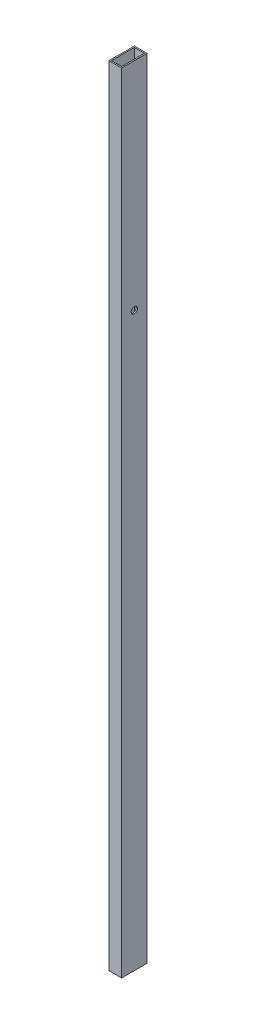
ISO-10303-21;
HEADER;
FILE_DESCRIPTION(('STEP AP214'),'2;1');
FILE_NAME('part.step','',(''),(''),'','','');
FILE_SCHEMA(('AUTOMOTIVE_DESIGN { 1 0 10303 214 1 1 1 1 }'));
ENDSEC;
DATA;
#1=APPLICATION_CONTEXT('core data for automotive mechanical design processes');
#2=APPLICATION_PROTOCOL_DEFINITION('international standard','automotive_design',2000,#1);
#3=PRODUCT_CONTEXT('',#1,'mechanical');
#4=PRODUCT('Part','Part','',(#3));
#5=PRODUCT_RELATED_PRODUCT_CATEGORY('part','',(#4));
#6=PRODUCT_DEFINITION_FORMATION('','',#4);
#7=PRODUCT_DEFINITION_CONTEXT('part definition',#1,'design');
#8=PRODUCT_DEFINITION('design','',#6,#7);
#9=PRODUCT_DEFINITION_SHAPE('','',#8);
#10=(LENGTH_UNIT() NAMED_UNIT(*) SI_UNIT(.MILLI.,.METRE.));
#11=(NAMED_UNIT(*) PLANE_ANGLE_UNIT() SI_UNIT($,.RADIAN.));
#12=(NAMED_UNIT(*) SI_UNIT($,.STERADIAN.) SOLID_ANGLE_UNIT());
#13=UNCERTAINTY_MEASURE_WITH_UNIT(LENGTH_MEASURE(1.E-05),#10,'distance_accuracy_value','');
#14=(GEOMETRIC_REPRESENTATION_CONTEXT(3) GLOBAL_UNCERTAINTY_ASSIGNED_CONTEXT((#13)) GLOBAL_UNIT_ASSIGNED_CONTEXT((#10,
#11,#12)) REPRESENTATION_CONTEXT('',''));
#15=CARTESIAN_POINT('',(0.,0.,0.));
#16=DIRECTION('',(0.,0.,1.));
#17=DIRECTION('',(1.,0.,0.));
#18=AXIS2_PLACEMENT_3D('',#15,#16,#17);
#19=CARTESIAN_POINT('',(0.,1240.,0.));
#20=DIRECTION('',(0.,1.,0.));
#21=DIRECTION('',(0.,0.,1.));
#22=AXIS2_PLACEMENT_3D('',#19,#20,#21);
#23=PLANE('',#22);
#24=DIRECTION('',(0.,0.,-1.));
#25=VECTOR('',#24,1.);
#26=CARTESIAN_POINT('',(9.99999999999999,1240.,-20.));
#27=LINE('',#26,#25);
#28=CARTESIAN_POINT('',(10.,1240.,20.));
#29=VERTEX_POINT('',#28);
#30=CARTESIAN_POINT('',(9.99999999999999,1240.,-20.));
#31=VERTEX_POINT('',#30);
#32=EDGE_CURVE('E163',#29,#31,#27,.T.);
#33=ORIENTED_EDGE('',*,*,#32,.T.);
#34=DIRECTION('',(-1.,0.,0.));
#35=VECTOR('',#34,1.);
#36=CARTESIAN_POINT('',(-10.,1240.,-20.));
#37=LINE('',#36,#35);
#38=CARTESIAN_POINT('',(-10.,1240.,-20.));
#39=VERTEX_POINT('',#38);
#40=EDGE_CURVE('E166',#31,#39,#37,.T.);
#41=ORIENTED_EDGE('',*,*,#40,.T.);
#42=DIRECTION('',(0.,0.,1.));
#43=VECTOR('',#42,1.);
#44=CARTESIAN_POINT('',(-10.,1240.,-20.));
#45=LINE('',#44,#43);
#46=CARTESIAN_POINT('',(-10.,1240.,20.));
#47=VERTEX_POINT('',#46);
#48=EDGE_CURVE('E169',#39,#47,#45,.T.);
#49=ORIENTED_EDGE('',*,*,#48,.T.);
#50=DIRECTION('',(1.,0.,0.));
#51=VECTOR('',#50,1.);
#52=CARTESIAN_POINT('',(-10.,1240.,20.));
#53=LINE('',#52,#51);
#54=EDGE_CURVE('E171',#47,#29,#53,.T.);
#55=ORIENTED_EDGE('',*,*,#54,.T.);
#56=EDGE_LOOP('',(#33,#41,#49,#55));
#57=FACE_BOUND('',#56,.T.);
#58=DIRECTION('',(-1.,0.,0.));
#59=VECTOR('',#58,1.);
#60=CARTESIAN_POINT('',(-10.,1240.,-18.));
#61=LINE('',#60,#59);
#62=CARTESIAN_POINT('',(7.99999999999999,1240.,-18.));
#63=VERTEX_POINT('',#62);
#64=CARTESIAN_POINT('',(-8.00000000000001,1240.,-18.));
#65=VERTEX_POINT('',#64);
#66=EDGE_CURVE('E133',#63,#65,#61,.T.);
#67=ORIENTED_EDGE('',*,*,#66,.F.);
#68=DIRECTION('',(0.,0.,-1.));
#69=VECTOR('',#68,1.);
#70=CARTESIAN_POINT('',(7.99999999999999,1240.,-20.));
#71=LINE('',#70,#69);
#72=CARTESIAN_POINT('',(8.,1240.,18.));
#73=VERTEX_POINT('',#72);
#74=EDGE_CURVE('E125',#73,#63,#71,.T.);
#75=ORIENTED_EDGE('',*,*,#74,.F.);
#76=DIRECTION('',(1.,0.,0.));
#77=VECTOR('',#76,1.);
#78=CARTESIAN_POINT('',(-10.,1240.,18.));
#79=LINE('',#78,#77);
#80=CARTESIAN_POINT('',(-8.,1240.,18.));
#81=VERTEX_POINT('',#80);
#82=EDGE_CURVE('E147',#81,#73,#79,.T.);
#83=ORIENTED_EDGE('',*,*,#82,.F.);
#84=DIRECTION('',(0.,0.,1.));
#85=VECTOR('',#84,1.);
#86=CARTESIAN_POINT('',(-8.00000000000001,1240.,-20.));
#87=LINE('',#86,#85);
#88=EDGE_CURVE('E145',#65,#81,#87,.T.);
#89=ORIENTED_EDGE('',*,*,#88,.F.);
#90=EDGE_LOOP('',(#67,#75,#83,#89));
#91=FACE_BOUND('',#90,.T.);
#92=ADVANCED_FACE('F58',(#57,#91),#23,.T.);
#93=CARTESIAN_POINT('',(0.,0.,0.));
#94=DIRECTION('',(0.,1.,0.));
#95=DIRECTION('',(0.,0.,1.));
#96=AXIS2_PLACEMENT_3D('',#93,#94,#95);
#97=PLANE('',#96);
#98=DIRECTION('',(0.,0.,-1.));
#99=VECTOR('',#98,1.);
#100=CARTESIAN_POINT('',(9.99999999999999,0.,-20.));
#101=LINE('',#100,#99);
#102=CARTESIAN_POINT('',(10.,0.,20.));
#103=VERTEX_POINT('',#102);
#104=CARTESIAN_POINT('',(9.99999999999999,0.,-20.));
#105=VERTEX_POINT('',#104);
#106=EDGE_CURVE('E141',#103,#105,#101,.T.);
#107=ORIENTED_EDGE('',*,*,#106,.F.);
#108=DIRECTION('',(1.,0.,0.));
#109=VECTOR('',#108,1.);
#110=CARTESIAN_POINT('',(-10.,0.,20.));
#111=LINE('',#110,#109);
#112=CARTESIAN_POINT('',(-10.,0.,20.));
#113=VERTEX_POINT('',#112);
#114=EDGE_CURVE('E167',#113,#103,#111,.T.);
#115=ORIENTED_EDGE('',*,*,#114,.F.);
#116=DIRECTION('',(0.,0.,1.));
#117=VECTOR('',#116,1.);
#118=CARTESIAN_POINT('',(-10.,0.,-20.));
#119=LINE('',#118,#117);
#120=CARTESIAN_POINT('',(-10.,0.,-20.));
#121=VERTEX_POINT('',#120);
#122=EDGE_CURVE('E178',#121,#113,#119,.T.);
#123=ORIENTED_EDGE('',*,*,#122,.F.);
#124=DIRECTION('',(-1.,0.,0.));
#125=VECTOR('',#124,1.);
#126=CARTESIAN_POINT('',(-10.,0.,-20.));
#127=LINE('',#126,#125);
#128=EDGE_CURVE('E176',#105,#121,#127,.T.);
#129=ORIENTED_EDGE('',*,*,#128,.F.);
#130=EDGE_LOOP('',(#107,#115,#123,#129));
#131=FACE_BOUND('',#130,.T.);
#132=DIRECTION('',(0.,0.,-1.));
#133=VECTOR('',#132,1.);
#134=CARTESIAN_POINT('',(7.99999999999999,0.,-20.));
#135=LINE('',#134,#133);
#136=CARTESIAN_POINT('',(8.,0.,18.));
#137=VERTEX_POINT('',#136);
#138=CARTESIAN_POINT('',(7.99999999999999,0.,-18.));
#139=VERTEX_POINT('',#138);
#140=EDGE_CURVE('E83',#137,#139,#135,.T.);
#141=ORIENTED_EDGE('',*,*,#140,.T.);
#142=DIRECTION('',(-1.,0.,0.));
#143=VECTOR('',#142,1.);
#144=CARTESIAN_POINT('',(-10.,0.,-18.));
#145=LINE('',#144,#143);
#146=CARTESIAN_POINT('',(-8.00000000000001,0.,-18.));
#147=VERTEX_POINT('',#146);
#148=EDGE_CURVE('E140',#139,#147,#145,.T.);
#149=ORIENTED_EDGE('',*,*,#148,.T.);
#150=DIRECTION('',(0.,0.,1.));
#151=VECTOR('',#150,1.);
#152=CARTESIAN_POINT('',(-8.00000000000001,0.,-20.));
#153=LINE('',#152,#151);
#154=CARTESIAN_POINT('',(-8.,0.,18.));
#155=VERTEX_POINT('',#154);
#156=EDGE_CURVE('E155',#147,#155,#153,.T.);
#157=ORIENTED_EDGE('',*,*,#156,.T.);
#158=DIRECTION('',(1.,0.,0.));
#159=VECTOR('',#158,1.);
#160=CARTESIAN_POINT('',(-10.,0.,18.));
#161=LINE('',#160,#159);
#162=EDGE_CURVE('E134',#155,#137,#161,.T.);
#163=ORIENTED_EDGE('',*,*,#162,.T.);
#164=EDGE_LOOP('',(#141,#149,#157,#163));
#165=FACE_BOUND('',#164,.T.);
#166=ADVANCED_FACE('F229',(#131,#165),#97,.F.);
#167=CARTESIAN_POINT('',(9.99999999999999,1240.,-20.));
#168=DIRECTION('',(-1.,0.,0.));
#169=DIRECTION('',(0.,0.,1.));
#170=AXIS2_PLACEMENT_3D('',#167,#168,#169);
#171=PLANE('',#170);
#172=CARTESIAN_POINT('',(10.,900.,0.));
#173=DIRECTION('',(1.,0.,0.));
#174=DIRECTION('',(0.,0.,-1.));
#175=AXIS2_PLACEMENT_3D('',#172,#173,#174);
#176=CIRCLE('',#175,5.00000000000001);
#177=CARTESIAN_POINT('',(10.,900.,-5.00000000000001));
#178=VERTEX_POINT('',#177);
#179=EDGE_CURVE('E200',#178,#178,#176,.T.);
#180=ORIENTED_EDGE('',*,*,#179,.F.);
#181=EDGE_LOOP('',(#180));
#182=FACE_BOUND('',#181,.T.);
#183=ORIENTED_EDGE('',*,*,#106,.T.);
#184=DIRECTION('',(0.,-1.,0.));
#185=VECTOR('',#184,1.);
#186=CARTESIAN_POINT('',(9.99999999999999,1240.,-20.));
#187=LINE('',#186,#185);
#188=EDGE_CURVE('E12',#31,#105,#187,.T.);
#189=ORIENTED_EDGE('',*,*,#188,.F.);
#190=ORIENTED_EDGE('',*,*,#32,.F.);
#191=DIRECTION('',(0.,-1.,0.));
#192=VECTOR('',#191,1.);
#193=CARTESIAN_POINT('',(10.,1240.,20.));
#194=LINE('',#193,#192);
#195=EDGE_CURVE('E173',#29,#103,#194,.T.);
#196=ORIENTED_EDGE('',*,*,#195,.T.);
#197=EDGE_LOOP('',(#183,#189,#190,#196));
#198=FACE_BOUND('',#197,.T.);
#199=ADVANCED_FACE('F60',(#182,#198),#171,.F.);
#200=CARTESIAN_POINT('',(-10.,1240.,-20.));
#201=DIRECTION('',(0.,0.,1.));
#202=DIRECTION('',(1.,0.,0.));
#203=AXIS2_PLACEMENT_3D('',#200,#201,#202);
#204=PLANE('',#203);
#205=ORIENTED_EDGE('',*,*,#128,.T.);
#206=DIRECTION('',(0.,-1.,0.));
#207=VECTOR('',#206,1.);
#208=CARTESIAN_POINT('',(-10.,1240.,-20.));
#209=LINE('',#208,#207);
#210=EDGE_CURVE('E67',#39,#121,#209,.T.);
#211=ORIENTED_EDGE('',*,*,#210,.F.);
#212=ORIENTED_EDGE('',*,*,#40,.F.);
#213=ORIENTED_EDGE('',*,*,#188,.T.);
#214=EDGE_LOOP('',(#205,#211,#212,#213));
#215=FACE_BOUND('',#214,.T.);
#216=ADVANCED_FACE('F238',(#215),#204,.F.);
#217=CARTESIAN_POINT('',(-10.,1240.,-20.));
#218=DIRECTION('',(1.,0.,0.));
#219=DIRECTION('',(0.,0.,-1.));
#220=AXIS2_PLACEMENT_3D('',#217,#218,#219);
#221=PLANE('',#220);
#222=CARTESIAN_POINT('',(-10.,720.,0.));
#223=DIRECTION('',(-1.,0.,0.));
#224=DIRECTION('',(0.,0.,1.));
#225=AXIS2_PLACEMENT_3D('',#222,#223,#224);
#226=CIRCLE('',#225,5.00000000000001);
#227=CARTESIAN_POINT('',(-10.,720.,5.00000000000001));
#228=VERTEX_POINT('',#227);
#229=EDGE_CURVE('E195',#228,#228,#226,.T.);
#230=ORIENTED_EDGE('',*,*,#229,.F.);
#231=EDGE_LOOP('',(#230));
#232=FACE_BOUND('',#231,.T.);
#233=CARTESIAN_POINT('',(-10.,580.,5.44676252517766E-12));
#234=DIRECTION('',(-1.,0.,0.));
#235=DIRECTION('',(0.,0.,1.));
#236=AXIS2_PLACEMENT_3D('',#233,#234,#235);
#237=CIRCLE('',#236,5.00000000000001);
#238=CARTESIAN_POINT('',(-10.,580.,5.00000000000546));
#239=VERTEX_POINT('',#238);
#240=EDGE_CURVE('E287',#239,#239,#237,.T.);
#241=ORIENTED_EDGE('',*,*,#240,.F.);
#242=EDGE_LOOP('',(#241));
#243=FACE_BOUND('',#242,.T.);
#244=CARTESIAN_POINT('',(-10.,440.,1.08922240077483E-11));
#245=DIRECTION('',(-1.,0.,0.));
#246=DIRECTION('',(0.,0.,1.));
#247=AXIS2_PLACEMENT_3D('',#244,#245,#246);
#248=CIRCLE('',#247,5.00000000000001);
#249=CARTESIAN_POINT('',(-10.,440.,5.0000000000109));
#250=VERTEX_POINT('',#249);
#251=EDGE_CURVE('E290',#250,#250,#248,.T.);
#252=ORIENTED_EDGE('',*,*,#251,.F.);
#253=EDGE_LOOP('',(#252));
#254=FACE_BOUND('',#253,.T.);
#255=CARTESIAN_POINT('',(-10.,900.,0.));
#256=DIRECTION('',(1.,0.,0.));
#257=DIRECTION('',(0.,0.,-1.));
#258=AXIS2_PLACEMENT_3D('',#255,#256,#257);
#259=CIRCLE('',#258,5.00000000000001);
#260=CARTESIAN_POINT('',(-10.,900.,-5.));
#261=VERTEX_POINT('',#260);
#262=EDGE_CURVE('E191',#261,#261,#259,.T.);
#263=ORIENTED_EDGE('',*,*,#262,.T.);
#264=EDGE_LOOP('',(#263));
#265=FACE_BOUND('',#264,.T.);
#266=ORIENTED_EDGE('',*,*,#122,.T.);
#267=DIRECTION('',(0.,-1.,0.));
#268=VECTOR('',#267,1.);
#269=CARTESIAN_POINT('',(-10.,1240.,20.));
#270=LINE('',#269,#268);
#271=EDGE_CURVE('E183',#47,#113,#270,.T.);
#272=ORIENTED_EDGE('',*,*,#271,.F.);
#273=ORIENTED_EDGE('',*,*,#48,.F.);
#274=ORIENTED_EDGE('',*,*,#210,.T.);
#275=EDGE_LOOP('',(#266,#272,#273,#274));
#276=FACE_BOUND('',#275,.T.);
#277=ADVANCED_FACE('F224',(#232,#243,#254,#265,#276),#221,.F.);
#278=CARTESIAN_POINT('',(-10.,1240.,20.));
#279=DIRECTION('',(0.,0.,-1.));
#280=DIRECTION('',(-1.,0.,0.));
#281=AXIS2_PLACEMENT_3D('',#278,#279,#280);
#282=PLANE('',#281);
#283=ORIENTED_EDGE('',*,*,#114,.T.);
#284=ORIENTED_EDGE('',*,*,#195,.F.);
#285=ORIENTED_EDGE('',*,*,#54,.F.);
#286=ORIENTED_EDGE('',*,*,#271,.T.);
#287=EDGE_LOOP('',(#283,#284,#285,#286));
#288=FACE_BOUND('',#287,.T.);
#289=ADVANCED_FACE('F216',(#288),#282,.F.);
#290=CARTESIAN_POINT('',(7.99999999999999,1240.,-20.));
#291=DIRECTION('',(-1.,0.,0.));
#292=DIRECTION('',(0.,0.,1.));
#293=AXIS2_PLACEMENT_3D('',#290,#291,#292);
#294=PLANE('',#293);
#295=CARTESIAN_POINT('',(8.,900.,0.));
#296=DIRECTION('',(-1.,0.,0.));
#297=DIRECTION('',(0.,0.,1.));
#298=AXIS2_PLACEMENT_3D('',#295,#296,#297);
#299=CIRCLE('',#298,5.00000000000001);
#300=CARTESIAN_POINT('',(8.,900.,5.00000000000001));
#301=VERTEX_POINT('',#300);
#302=EDGE_CURVE('E153',#301,#301,#299,.T.);
#303=ORIENTED_EDGE('',*,*,#302,.F.);
#304=EDGE_LOOP('',(#303));
#305=FACE_BOUND('',#304,.T.);
#306=ORIENTED_EDGE('',*,*,#140,.F.);
#307=DIRECTION('',(0.,-1.,0.));
#308=VECTOR('',#307,1.);
#309=CARTESIAN_POINT('',(8.,1240.,18.));
#310=LINE('',#309,#308);
#311=EDGE_CURVE('E129',#73,#137,#310,.T.);
#312=ORIENTED_EDGE('',*,*,#311,.F.);
#313=ORIENTED_EDGE('',*,*,#74,.T.);
#314=DIRECTION('',(0.,-1.,0.));
#315=VECTOR('',#314,1.);
#316=CARTESIAN_POINT('',(7.99999999999999,1240.,-18.));
#317=LINE('',#316,#315);
#318=EDGE_CURVE('E128',#63,#139,#317,.T.);
#319=ORIENTED_EDGE('',*,*,#318,.T.);
#320=EDGE_LOOP('',(#306,#312,#313,#319));
#321=FACE_BOUND('',#320,.T.);
#322=ADVANCED_FACE('F127',(#305,#321),#294,.T.);
#323=CARTESIAN_POINT('',(-10.,1240.,-18.));
#324=DIRECTION('',(0.,0.,1.));
#325=DIRECTION('',(1.,0.,0.));
#326=AXIS2_PLACEMENT_3D('',#323,#324,#325);
#327=PLANE('',#326);
#328=ORIENTED_EDGE('',*,*,#148,.F.);
#329=ORIENTED_EDGE('',*,*,#318,.F.);
#330=ORIENTED_EDGE('',*,*,#66,.T.);
#331=DIRECTION('',(0.,-1.,0.));
#332=VECTOR('',#331,1.);
#333=CARTESIAN_POINT('',(-8.00000000000001,1240.,-18.));
#334=LINE('',#333,#332);
#335=EDGE_CURVE('E142',#65,#147,#334,.T.);
#336=ORIENTED_EDGE('',*,*,#335,.T.);
#337=EDGE_LOOP('',(#328,#329,#330,#336));
#338=FACE_BOUND('',#337,.T.);
#339=ADVANCED_FACE('F137',(#338),#327,.T.);
#340=CARTESIAN_POINT('',(-8.00000000000001,1240.,-20.));
#341=DIRECTION('',(1.,0.,0.));
#342=DIRECTION('',(0.,0.,-1.));
#343=AXIS2_PLACEMENT_3D('',#340,#341,#342);
#344=PLANE('',#343);
#345=CARTESIAN_POINT('',(-8.,720.,0.));
#346=DIRECTION('',(1.,0.,0.));
#347=DIRECTION('',(0.,0.,-1.));
#348=AXIS2_PLACEMENT_3D('',#345,#346,#347);
#349=CIRCLE('',#348,5.00000000000001);
#350=CARTESIAN_POINT('',(-8.,720.,-5.00000000000001));
#351=VERTEX_POINT('',#350);
#352=EDGE_CURVE('E62',#351,#351,#349,.T.);
#353=ORIENTED_EDGE('',*,*,#352,.F.);
#354=EDGE_LOOP('',(#353));
#355=FACE_BOUND('',#354,.T.);
#356=CARTESIAN_POINT('',(-8.,580.,5.44650231665626E-12));
#357=DIRECTION('',(1.,0.,0.));
#358=DIRECTION('',(0.,0.,-1.));
#359=AXIS2_PLACEMENT_3D('',#356,#357,#358);
#360=CIRCLE('',#359,5.00000000000001);
#361=CARTESIAN_POINT('',(-8.,580.,-4.99999999999456));
#362=VERTEX_POINT('',#361);
#363=EDGE_CURVE('E194',#362,#362,#360,.T.);
#364=ORIENTED_EDGE('',*,*,#363,.F.);
#365=EDGE_LOOP('',(#364));
#366=FACE_BOUND('',#365,.T.);
#367=CARTESIAN_POINT('',(-8.,440.,1.08919637992269E-11));
#368=DIRECTION('',(1.,0.,0.));
#369=DIRECTION('',(0.,0.,-1.));
#370=AXIS2_PLACEMENT_3D('',#367,#368,#369);
#371=CIRCLE('',#370,5.00000000000001);
#372=CARTESIAN_POINT('',(-8.,440.,-4.99999999998912));
#373=VERTEX_POINT('',#372);
#374=EDGE_CURVE('E192',#373,#373,#371,.T.);
#375=ORIENTED_EDGE('',*,*,#374,.F.);
#376=EDGE_LOOP('',(#375));
#377=FACE_BOUND('',#376,.T.);
#378=CARTESIAN_POINT('',(-8.,900.,0.));
#379=DIRECTION('',(1.,0.,0.));
#380=DIRECTION('',(0.,0.,-1.));
#381=AXIS2_PLACEMENT_3D('',#378,#379,#380);
#382=CIRCLE('',#381,5.00000000000001);
#383=CARTESIAN_POINT('',(-8.,900.,-5.00000000000001));
#384=VERTEX_POINT('',#383);
#385=EDGE_CURVE('E188',#384,#384,#382,.T.);
#386=ORIENTED_EDGE('',*,*,#385,.F.);
#387=EDGE_LOOP('',(#386));
#388=FACE_BOUND('',#387,.T.);
#389=ORIENTED_EDGE('',*,*,#156,.F.);
#390=ORIENTED_EDGE('',*,*,#335,.F.);
#391=ORIENTED_EDGE('',*,*,#88,.T.);
#392=DIRECTION('',(0.,-1.,0.));
#393=VECTOR('',#392,1.);
#394=CARTESIAN_POINT('',(-8.,1240.,18.));
#395=LINE('',#394,#393);
#396=EDGE_CURVE('E75',#81,#155,#395,.T.);
#397=ORIENTED_EDGE('',*,*,#396,.T.);
#398=EDGE_LOOP('',(#389,#390,#391,#397));
#399=FACE_BOUND('',#398,.T.);
#400=ADVANCED_FACE('F222',(#355,#366,#377,#388,#399),#344,.T.);
#401=CARTESIAN_POINT('',(-10.,1240.,18.));
#402=DIRECTION('',(0.,0.,-1.));
#403=DIRECTION('',(-1.,0.,0.));
#404=AXIS2_PLACEMENT_3D('',#401,#402,#403);
#405=PLANE('',#404);
#406=ORIENTED_EDGE('',*,*,#162,.F.);
#407=ORIENTED_EDGE('',*,*,#396,.F.);
#408=ORIENTED_EDGE('',*,*,#82,.T.);
#409=ORIENTED_EDGE('',*,*,#311,.T.);
#410=EDGE_LOOP('',(#406,#407,#408,#409));
#411=FACE_BOUND('',#410,.T.);
#412=ADVANCED_FACE('F260',(#411),#405,.T.);
#413=CARTESIAN_POINT('',(-10.,900.,0.));
#414=DIRECTION('',(1.,0.,0.));
#415=DIRECTION('',(0.,0.,-1.));
#416=AXIS2_PLACEMENT_3D('',#413,#414,#415);
#417=CYLINDRICAL_SURFACE('',#416,5.00000000000001);
#418=ORIENTED_EDGE('',*,*,#385,.T.);
#419=EDGE_LOOP('',(#418));
#420=FACE_BOUND('',#419,.T.);
#421=ORIENTED_EDGE('',*,*,#262,.F.);
#422=EDGE_LOOP('',(#421));
#423=FACE_BOUND('',#422,.T.);
#424=ADVANCED_FACE('F262',(#420,#423),#417,.F.);
#425=ORIENTED_EDGE('',*,*,#302,.T.);
#426=EDGE_LOOP('',(#425));
#427=FACE_BOUND('',#426,.T.);
#428=ORIENTED_EDGE('',*,*,#179,.T.);
#429=EDGE_LOOP('',(#428));
#430=FACE_BOUND('',#429,.T.);
#431=ADVANCED_FACE('F213',(#427,#430),#417,.F.);
#432=CARTESIAN_POINT('',(0.,440.,1.08909229651414E-11));
#433=DIRECTION('',(-1.,0.,0.));
#434=DIRECTION('',(0.,0.,1.));
#435=AXIS2_PLACEMENT_3D('',#432,#433,#434);
#436=CYLINDRICAL_SURFACE('',#435,5.00000000000001);
#437=ORIENTED_EDGE('',*,*,#374,.T.);
#438=EDGE_LOOP('',(#437));
#439=FACE_BOUND('',#438,.T.);
#440=ORIENTED_EDGE('',*,*,#251,.T.);
#441=EDGE_LOOP('',(#440));
#442=FACE_BOUND('',#441,.T.);
#443=ADVANCED_FACE('F273',(#439,#442),#436,.F.);
#444=CARTESIAN_POINT('',(0.,580.,5.44546148257068E-12));
#445=DIRECTION('',(-1.,0.,0.));
#446=DIRECTION('',(0.,0.,1.));
#447=AXIS2_PLACEMENT_3D('',#444,#445,#446);
#448=CYLINDRICAL_SURFACE('',#447,5.00000000000001);
#449=ORIENTED_EDGE('',*,*,#363,.T.);
#450=EDGE_LOOP('',(#449));
#451=FACE_BOUND('',#450,.T.);
#452=ORIENTED_EDGE('',*,*,#240,.T.);
#453=EDGE_LOOP('',(#452));
#454=FACE_BOUND('',#453,.T.);
#455=ADVANCED_FACE('F276',(#451,#454),#448,.F.);
#456=CARTESIAN_POINT('',(0.,720.,0.));
#457=DIRECTION('',(-1.,0.,0.));
#458=DIRECTION('',(0.,0.,1.));
#459=AXIS2_PLACEMENT_3D('',#456,#457,#458);
#460=CYLINDRICAL_SURFACE('',#459,5.00000000000001);
#461=ORIENTED_EDGE('',*,*,#352,.T.);
#462=EDGE_LOOP('',(#461));
#463=FACE_BOUND('',#462,.T.);
#464=ORIENTED_EDGE('',*,*,#229,.T.);
#465=EDGE_LOOP('',(#464));
#466=FACE_BOUND('',#465,.T.);
#467=ADVANCED_FACE('F280',(#463,#466),#460,.F.);
#468=CLOSED_SHELL('',(#92,#166,#199,#216,#277,#289,#322,#339,#400,#412,#424,#431,#443,#455,#467));
#469=MANIFOLD_SOLID_BREP('B2',#468);
#470=ADVANCED_BREP_SHAPE_REPRESENTATION('',(#18,#469),#14);
#471=SHAPE_DEFINITION_REPRESENTATION(#9,#470);
ENDSEC;
END-ISO-10303-21;
